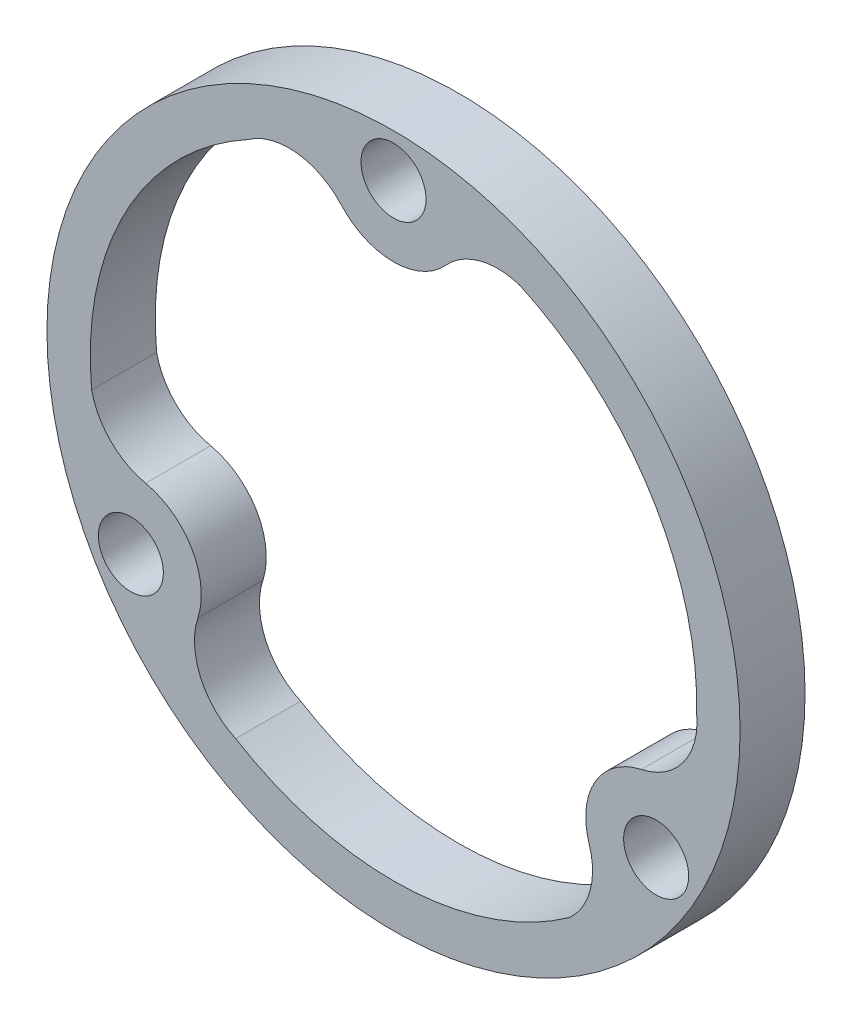
ISO-10303-21;
HEADER;
FILE_DESCRIPTION(('STEP AP214'),'2;1');
FILE_NAME('part.step','',(''),(''),'','','');
FILE_SCHEMA(('AUTOMOTIVE_DESIGN { 1 0 10303 214 1 1 1 1 }'));
ENDSEC;
DATA;
#1=APPLICATION_CONTEXT('core data for automotive mechanical design processes');
#2=APPLICATION_PROTOCOL_DEFINITION('international standard','automotive_design',2000,#1);
#3=PRODUCT_CONTEXT('',#1,'mechanical');
#4=PRODUCT('Part','Part','',(#3));
#5=PRODUCT_RELATED_PRODUCT_CATEGORY('part','',(#4));
#6=PRODUCT_DEFINITION_FORMATION('','',#4);
#7=PRODUCT_DEFINITION_CONTEXT('part definition',#1,'design');
#8=PRODUCT_DEFINITION('design','',#6,#7);
#9=PRODUCT_DEFINITION_SHAPE('','',#8);
#10=(LENGTH_UNIT() NAMED_UNIT(*) SI_UNIT(.MILLI.,.METRE.));
#11=(NAMED_UNIT(*) PLANE_ANGLE_UNIT() SI_UNIT($,.RADIAN.));
#12=(NAMED_UNIT(*) SI_UNIT($,.STERADIAN.) SOLID_ANGLE_UNIT());
#13=UNCERTAINTY_MEASURE_WITH_UNIT(LENGTH_MEASURE(1.E-05),#10,'distance_accuracy_value','');
#14=(GEOMETRIC_REPRESENTATION_CONTEXT(3) GLOBAL_UNCERTAINTY_ASSIGNED_CONTEXT((#13)) GLOBAL_UNIT_ASSIGNED_CONTEXT((#10,
#11,#12)) REPRESENTATION_CONTEXT('',''));
#15=CARTESIAN_POINT('',(0.,0.,0.));
#16=DIRECTION('',(0.,0.,1.));
#17=DIRECTION('',(1.,0.,0.));
#18=AXIS2_PLACEMENT_3D('',#15,#16,#17);
#19=CARTESIAN_POINT('',(0.,0.,3.));
#20=DIRECTION('',(0.,0.,1.));
#21=DIRECTION('',(1.,0.,0.));
#22=AXIS2_PLACEMENT_3D('',#19,#20,#21);
#23=PLANE('',#22);
#24=CARTESIAN_POINT('',(0.,0.,3.));
#25=DIRECTION('',(0.,0.,1.));
#26=DIRECTION('',(1.,0.,0.));
#27=AXIS2_PLACEMENT_3D('',#24,#25,#26);
#28=CIRCLE('',#27,14.);
#29=CARTESIAN_POINT('',(13.9959775932849,-0.335575935174573,3.));
#30=VERTEX_POINT('',#29);
#31=CARTESIAN_POINT('',(5.80943087987062,12.7377593340432,3.));
#32=VERTEX_POINT('',#31);
#33=EDGE_CURVE('E130',#30,#32,#28,.T.);
#34=ORIENTED_EDGE('',*,*,#33,.F.);
#35=CARTESIAN_POINT('',(10.7607074751454,-0.644650784804921,3.));
#36=DIRECTION('',(0.,0.,1.));
#37=DIRECTION('',(1.,0.,0.));
#38=AXIS2_PLACEMENT_3D('',#35,#36,#37);
#39=CIRCLE('',#38,3.25);
#40=CARTESIAN_POINT('',(11.4425315640637,-3.82232539240255,3.));
#41=VERTEX_POINT('',#40);
#42=EDGE_CURVE('E122',#41,#30,#39,.T.);
#43=ORIENTED_EDGE('',*,*,#42,.F.);
#44=CARTESIAN_POINT('',(12.124355652982,-7.00000000000017,3.));
#45=DIRECTION('',(0.,0.,-1.));
#46=DIRECTION('',(1.,0.,0.));
#47=AXIS2_PLACEMENT_3D('',#44,#45,#46);
#48=CIRCLE('',#47,3.25);
#49=CARTESIAN_POINT('',(9.03149667338257,-7.99836032188346,3.));
#50=VERTEX_POINT('',#49);
#51=EDGE_CURVE('E165',#50,#41,#48,.T.);
#52=ORIENTED_EDGE('',*,*,#51,.F.);
#53=CARTESIAN_POINT('',(5.93863769378309,-8.99672064376674,3.));
#54=DIRECTION('',(0.,0.,1.));
#55=DIRECTION('',(1.,0.,0.));
#56=AXIS2_PLACEMENT_3D('',#53,#54,#55);
#57=CIRCLE('',#56,3.25);
#58=CARTESIAN_POINT('',(8.12650773063849,-11.3999943905194,3.));
#59=VERTEX_POINT('',#58);
#60=EDGE_CURVE('E163',#59,#50,#57,.T.);
#61=ORIENTED_EDGE('',*,*,#60,.F.);
#62=CARTESIAN_POINT('',(0.,0.,3.));
#63=DIRECTION('',(0.,0.,1.));
#64=DIRECTION('',(1.,0.,0.));
#65=AXIS2_PLACEMENT_3D('',#62,#63,#64);
#66=CIRCLE('',#65,14.);
#67=CARTESIAN_POINT('',(-7.28860608140232,-11.9530841789952,3.));
#68=VERTEX_POINT('',#67);
#69=EDGE_CURVE('E161',#68,#59,#66,.T.);
#70=ORIENTED_EDGE('',*,*,#69,.F.);
#71=CARTESIAN_POINT('',(-5.93863769378334,-8.99672064376658,3.));
#72=DIRECTION('',(0.,0.,1.));
#73=DIRECTION('',(1.,0.,0.));
#74=AXIS2_PLACEMENT_3D('',#71,#72,#73);
#75=CIRCLE('',#74,3.25);
#76=CARTESIAN_POINT('',(-9.03149667338279,-7.9983603218832,3.));
#77=VERTEX_POINT('',#76);
#78=EDGE_CURVE('E159',#77,#68,#75,.T.);
#79=ORIENTED_EDGE('',*,*,#78,.F.);
#80=CARTESIAN_POINT('',(-12.1243556529822,-6.99999999999983,3.));
#81=DIRECTION('',(0.,0.,-1.));
#82=DIRECTION('',(1.,0.,0.));
#83=AXIS2_PLACEMENT_3D('',#80,#81,#82);
#84=CIRCLE('',#83,3.25);
#85=CARTESIAN_POINT('',(-11.4425315640638,-3.82232539240223,3.));
#86=VERTEX_POINT('',#85);
#87=EDGE_CURVE('E157',#86,#77,#84,.T.);
#88=ORIENTED_EDGE('',*,*,#87,.F.);
#89=CARTESIAN_POINT('',(-10.7607074751454,-0.644650784804622,3.));
#90=DIRECTION('',(0.,0.,1.));
#91=DIRECTION('',(1.,0.,0.));
#92=AXIS2_PLACEMENT_3D('',#89,#90,#91);
#93=CIRCLE('',#92,3.25);
#94=CARTESIAN_POINT('',(-13.9359386105091,-1.33776494352389,3.));
#95=VERTEX_POINT('',#94);
#96=EDGE_CURVE('E155',#95,#86,#93,.T.);
#97=ORIENTED_EDGE('',*,*,#96,.F.);
#98=CARTESIAN_POINT('',(0.,0.,3.));
#99=DIRECTION('',(0.,0.,1.));
#100=DIRECTION('',(1.,0.,0.));
#101=AXIS2_PLACEMENT_3D('',#98,#99,#100);
#102=CIRCLE('',#101,14.);
#103=CARTESIAN_POINT('',(-6.70737151188253,12.2886601141698,3.));
#104=VERTEX_POINT('',#103);
#105=EDGE_CURVE('E153',#104,#95,#102,.T.);
#106=ORIENTED_EDGE('',*,*,#105,.F.);
#107=CARTESIAN_POINT('',(-4.82206978136206,9.6413714285715,3.));
#108=DIRECTION('',(0.,0.,1.));
#109=DIRECTION('',(1.,0.,0.));
#110=AXIS2_PLACEMENT_3D('',#107,#108,#109);
#111=CIRCLE('',#110,3.25);
#112=CARTESIAN_POINT('',(-2.41103489068093,11.8206857142857,3.));
#113=VERTEX_POINT('',#112);
#114=EDGE_CURVE('E151',#113,#104,#111,.T.);
#115=ORIENTED_EDGE('',*,*,#114,.F.);
#116=CARTESIAN_POINT('',(1.99573676599621E-13,14.,3.));
#117=DIRECTION('',(0.,0.,-1.));
#118=DIRECTION('',(1.,0.,0.));
#119=AXIS2_PLACEMENT_3D('',#116,#117,#118);
#120=CIRCLE('',#119,3.25);
#121=CARTESIAN_POINT('',(2.41103489068127,11.8206857142857,3.));
#122=VERTEX_POINT('',#121);
#123=EDGE_CURVE('E146',#122,#113,#120,.T.);
#124=ORIENTED_EDGE('',*,*,#123,.F.);
#125=CARTESIAN_POINT('',(4.82206978136234,9.64137142857136,3.));
#126=DIRECTION('',(0.,0.,1.));
#127=DIRECTION('',(1.,0.,0.));
#128=AXIS2_PLACEMENT_3D('',#125,#126,#127);
#129=CIRCLE('',#128,3.25);
#130=EDGE_CURVE('E144',#32,#122,#129,.T.);
#131=ORIENTED_EDGE('',*,*,#130,.F.);
#132=EDGE_LOOP('',(#34,#43,#52,#61,#70,#79,#88,#97,#106,#115,#124,#131));
#133=FACE_BOUND('',#132,.T.);
#134=CARTESIAN_POINT('',(12.124355652982,-7.00000000000017,3.));
#135=DIRECTION('',(0.,0.,1.));
#136=DIRECTION('',(1.,0.,0.));
#137=AXIS2_PLACEMENT_3D('',#134,#135,#136);
#138=CIRCLE('',#137,1.50000000000007);
#139=CARTESIAN_POINT('',(13.6243556529821,-7.00000000000017,3.));
#140=VERTEX_POINT('',#139);
#141=EDGE_CURVE('E218',#140,#140,#138,.T.);
#142=ORIENTED_EDGE('',*,*,#141,.F.);
#143=EDGE_LOOP('',(#142));
#144=FACE_BOUND('',#143,.T.);
#145=CARTESIAN_POINT('',(0.,0.,3.));
#146=DIRECTION('',(0.,0.,1.));
#147=DIRECTION('',(1.,0.,0.));
#148=AXIS2_PLACEMENT_3D('',#145,#146,#147);
#149=CIRCLE('',#148,16.);
#150=CARTESIAN_POINT('',(16.,0.,3.));
#151=VERTEX_POINT('',#150);
#152=EDGE_CURVE('E11',#151,#151,#149,.T.);
#153=ORIENTED_EDGE('',*,*,#152,.T.);
#154=EDGE_LOOP('',(#153));
#155=FACE_BOUND('',#154,.T.);
#156=CARTESIAN_POINT('',(1.99573676599621E-13,14.,3.));
#157=DIRECTION('',(0.,0.,1.));
#158=DIRECTION('',(1.,0.,0.));
#159=AXIS2_PLACEMENT_3D('',#156,#157,#158);
#160=CIRCLE('',#159,1.50000000000001);
#161=CARTESIAN_POINT('',(1.5000000000002,14.,3.));
#162=VERTEX_POINT('',#161);
#163=EDGE_CURVE('E224',#162,#162,#160,.T.);
#164=ORIENTED_EDGE('',*,*,#163,.F.);
#165=EDGE_LOOP('',(#164));
#166=FACE_BOUND('',#165,.T.);
#167=CARTESIAN_POINT('',(-12.1243556529822,-6.99999999999983,3.));
#168=DIRECTION('',(0.,0.,1.));
#169=DIRECTION('',(1.,0.,0.));
#170=AXIS2_PLACEMENT_3D('',#167,#168,#169);
#171=CIRCLE('',#170,1.5);
#172=CARTESIAN_POINT('',(-10.6243556529822,-6.99999999999983,3.));
#173=VERTEX_POINT('',#172);
#174=EDGE_CURVE('E168',#173,#173,#171,.T.);
#175=ORIENTED_EDGE('',*,*,#174,.F.);
#176=EDGE_LOOP('',(#175));
#177=FACE_BOUND('',#176,.T.);
#178=ADVANCED_FACE('F33',(#133,#144,#155,#166,#177),#23,.T.);
#179=CARTESIAN_POINT('',(0.,0.,0.));
#180=DIRECTION('',(0.,0.,1.));
#181=DIRECTION('',(1.,0.,0.));
#182=AXIS2_PLACEMENT_3D('',#179,#180,#181);
#183=PLANE('',#182);
#184=CARTESIAN_POINT('',(12.124355652982,-7.00000000000017,0.));
#185=DIRECTION('',(0.,0.,1.));
#186=DIRECTION('',(1.,0.,0.));
#187=AXIS2_PLACEMENT_3D('',#184,#185,#186);
#188=CIRCLE('',#187,1.50000000000007);
#189=CARTESIAN_POINT('',(13.6243556529821,-7.00000000000017,0.));
#190=VERTEX_POINT('',#189);
#191=EDGE_CURVE('E138',#190,#190,#188,.T.);
#192=ORIENTED_EDGE('',*,*,#191,.T.);
#193=EDGE_LOOP('',(#192));
#194=FACE_BOUND('',#193,.T.);
#195=CARTESIAN_POINT('',(1.99573676599621E-13,14.,0.));
#196=DIRECTION('',(0.,0.,1.));
#197=DIRECTION('',(1.,0.,0.));
#198=AXIS2_PLACEMENT_3D('',#195,#196,#197);
#199=CIRCLE('',#198,1.50000000000001);
#200=CARTESIAN_POINT('',(1.5000000000002,14.,0.));
#201=VERTEX_POINT('',#200);
#202=EDGE_CURVE('E221',#201,#201,#199,.T.);
#203=ORIENTED_EDGE('',*,*,#202,.T.);
#204=EDGE_LOOP('',(#203));
#205=FACE_BOUND('',#204,.T.);
#206=CARTESIAN_POINT('',(0.,0.,0.));
#207=DIRECTION('',(0.,0.,1.));
#208=DIRECTION('',(1.,0.,0.));
#209=AXIS2_PLACEMENT_3D('',#206,#207,#208);
#210=CIRCLE('',#209,16.);
#211=CARTESIAN_POINT('',(16.,0.,0.));
#212=VERTEX_POINT('',#211);
#213=EDGE_CURVE('E37',#212,#212,#210,.T.);
#214=ORIENTED_EDGE('',*,*,#213,.F.);
#215=EDGE_LOOP('',(#214));
#216=FACE_BOUND('',#215,.T.);
#217=CARTESIAN_POINT('',(10.7607074751454,-0.644650784804921,0.));
#218=DIRECTION('',(0.,0.,1.));
#219=DIRECTION('',(1.,0.,0.));
#220=AXIS2_PLACEMENT_3D('',#217,#218,#219);
#221=CIRCLE('',#220,3.25);
#222=CARTESIAN_POINT('',(11.4425315640637,-3.82232539240255,0.));
#223=VERTEX_POINT('',#222);
#224=CARTESIAN_POINT('',(13.9959775932849,-0.335575935174573,0.));
#225=VERTEX_POINT('',#224);
#226=EDGE_CURVE('E56',#223,#225,#221,.T.);
#227=ORIENTED_EDGE('',*,*,#226,.T.);
#228=CARTESIAN_POINT('',(0.,0.,0.));
#229=DIRECTION('',(0.,0.,1.));
#230=DIRECTION('',(1.,0.,0.));
#231=AXIS2_PLACEMENT_3D('',#228,#229,#230);
#232=CIRCLE('',#231,14.);
#233=CARTESIAN_POINT('',(5.80943087987062,12.7377593340432,0.));
#234=VERTEX_POINT('',#233);
#235=EDGE_CURVE('E137',#225,#234,#232,.T.);
#236=ORIENTED_EDGE('',*,*,#235,.T.);
#237=CARTESIAN_POINT('',(4.82206978136234,9.64137142857136,0.));
#238=DIRECTION('',(0.,0.,1.));
#239=DIRECTION('',(1.,0.,0.));
#240=AXIS2_PLACEMENT_3D('',#237,#238,#239);
#241=CIRCLE('',#240,3.25);
#242=CARTESIAN_POINT('',(2.41103489068127,11.8206857142857,0.));
#243=VERTEX_POINT('',#242);
#244=EDGE_CURVE('E170',#234,#243,#241,.T.);
#245=ORIENTED_EDGE('',*,*,#244,.T.);
#246=CARTESIAN_POINT('',(1.99573676599621E-13,14.,0.));
#247=DIRECTION('',(0.,0.,-1.));
#248=DIRECTION('',(1.,0.,0.));
#249=AXIS2_PLACEMENT_3D('',#246,#247,#248);
#250=CIRCLE('',#249,3.25);
#251=CARTESIAN_POINT('',(-2.41103489068093,11.8206857142857,0.));
#252=VERTEX_POINT('',#251);
#253=EDGE_CURVE('E173',#243,#252,#250,.T.);
#254=ORIENTED_EDGE('',*,*,#253,.T.);
#255=CARTESIAN_POINT('',(-4.82206978136206,9.6413714285715,0.));
#256=DIRECTION('',(0.,0.,1.));
#257=DIRECTION('',(1.,0.,0.));
#258=AXIS2_PLACEMENT_3D('',#255,#256,#257);
#259=CIRCLE('',#258,3.25);
#260=CARTESIAN_POINT('',(-6.70737151188253,12.2886601141698,0.));
#261=VERTEX_POINT('',#260);
#262=EDGE_CURVE('E176',#252,#261,#259,.T.);
#263=ORIENTED_EDGE('',*,*,#262,.T.);
#264=CARTESIAN_POINT('',(0.,0.,0.));
#265=DIRECTION('',(0.,0.,1.));
#266=DIRECTION('',(1.,0.,0.));
#267=AXIS2_PLACEMENT_3D('',#264,#265,#266);
#268=CIRCLE('',#267,14.);
#269=CARTESIAN_POINT('',(-13.9359386105091,-1.33776494352389,0.));
#270=VERTEX_POINT('',#269);
#271=EDGE_CURVE('E179',#261,#270,#268,.T.);
#272=ORIENTED_EDGE('',*,*,#271,.T.);
#273=CARTESIAN_POINT('',(-10.7607074751454,-0.644650784804622,0.));
#274=DIRECTION('',(0.,0.,1.));
#275=DIRECTION('',(1.,0.,0.));
#276=AXIS2_PLACEMENT_3D('',#273,#274,#275);
#277=CIRCLE('',#276,3.25);
#278=CARTESIAN_POINT('',(-11.4425315640638,-3.82232539240223,0.));
#279=VERTEX_POINT('',#278);
#280=EDGE_CURVE('E182',#270,#279,#277,.T.);
#281=ORIENTED_EDGE('',*,*,#280,.T.);
#282=CARTESIAN_POINT('',(-12.1243556529822,-6.99999999999983,0.));
#283=DIRECTION('',(0.,0.,-1.));
#284=DIRECTION('',(1.,0.,0.));
#285=AXIS2_PLACEMENT_3D('',#282,#283,#284);
#286=CIRCLE('',#285,3.25);
#287=CARTESIAN_POINT('',(-9.03149667338279,-7.9983603218832,0.));
#288=VERTEX_POINT('',#287);
#289=EDGE_CURVE('E185',#279,#288,#286,.T.);
#290=ORIENTED_EDGE('',*,*,#289,.T.);
#291=CARTESIAN_POINT('',(-5.93863769378334,-8.99672064376658,0.));
#292=DIRECTION('',(0.,0.,1.));
#293=DIRECTION('',(1.,0.,0.));
#294=AXIS2_PLACEMENT_3D('',#291,#292,#293);
#295=CIRCLE('',#294,3.25);
#296=CARTESIAN_POINT('',(-7.28860608140232,-11.9530841789952,0.));
#297=VERTEX_POINT('',#296);
#298=EDGE_CURVE('E188',#288,#297,#295,.T.);
#299=ORIENTED_EDGE('',*,*,#298,.T.);
#300=CARTESIAN_POINT('',(0.,0.,0.));
#301=DIRECTION('',(0.,0.,1.));
#302=DIRECTION('',(1.,0.,0.));
#303=AXIS2_PLACEMENT_3D('',#300,#301,#302);
#304=CIRCLE('',#303,14.);
#305=CARTESIAN_POINT('',(8.12650773063849,-11.3999943905194,0.));
#306=VERTEX_POINT('',#305);
#307=EDGE_CURVE('E191',#297,#306,#304,.T.);
#308=ORIENTED_EDGE('',*,*,#307,.T.);
#309=CARTESIAN_POINT('',(5.93863769378309,-8.99672064376674,0.));
#310=DIRECTION('',(0.,0.,1.));
#311=DIRECTION('',(1.,0.,0.));
#312=AXIS2_PLACEMENT_3D('',#309,#310,#311);
#313=CIRCLE('',#312,3.25);
#314=CARTESIAN_POINT('',(9.03149667338257,-7.99836032188346,0.));
#315=VERTEX_POINT('',#314);
#316=EDGE_CURVE('E194',#306,#315,#313,.T.);
#317=ORIENTED_EDGE('',*,*,#316,.T.);
#318=CARTESIAN_POINT('',(12.124355652982,-7.00000000000017,0.));
#319=DIRECTION('',(0.,0.,-1.));
#320=DIRECTION('',(1.,0.,0.));
#321=AXIS2_PLACEMENT_3D('',#318,#319,#320);
#322=CIRCLE('',#321,3.25);
#323=EDGE_CURVE('E131',#315,#223,#322,.T.);
#324=ORIENTED_EDGE('',*,*,#323,.T.);
#325=EDGE_LOOP('',(#227,#236,#245,#254,#263,#272,#281,#290,#299,#308,#317,#324));
#326=FACE_BOUND('',#325,.T.);
#327=CARTESIAN_POINT('',(-12.1243556529822,-6.99999999999983,0.));
#328=DIRECTION('',(0.,0.,1.));
#329=DIRECTION('',(1.,0.,0.));
#330=AXIS2_PLACEMENT_3D('',#327,#328,#329);
#331=CIRCLE('',#330,1.5);
#332=CARTESIAN_POINT('',(-10.6243556529822,-6.99999999999983,0.));
#333=VERTEX_POINT('',#332);
#334=EDGE_CURVE('E403',#333,#333,#331,.T.);
#335=ORIENTED_EDGE('',*,*,#334,.T.);
#336=EDGE_LOOP('',(#335));
#337=FACE_BOUND('',#336,.T.);
#338=ADVANCED_FACE('F230',(#194,#205,#216,#326,#337),#183,.F.);
#339=CARTESIAN_POINT('',(0.,0.,3.));
#340=DIRECTION('',(0.,0.,-1.));
#341=DIRECTION('',(-1.,0.,0.));
#342=AXIS2_PLACEMENT_3D('',#339,#340,#341);
#343=CYLINDRICAL_SURFACE('',#342,16.);
#344=ORIENTED_EDGE('',*,*,#152,.F.);
#345=EDGE_LOOP('',(#344));
#346=FACE_BOUND('',#345,.T.);
#347=ORIENTED_EDGE('',*,*,#213,.T.);
#348=EDGE_LOOP('',(#347));
#349=FACE_BOUND('',#348,.T.);
#350=ADVANCED_FACE('F35',(#346,#349),#343,.T.);
#351=CARTESIAN_POINT('',(1.99573676599621E-13,14.,3.));
#352=DIRECTION('',(0.,0.,-1.));
#353=DIRECTION('',(-1.,0.,0.));
#354=AXIS2_PLACEMENT_3D('',#351,#352,#353);
#355=CYLINDRICAL_SURFACE('',#354,1.50000000000001);
#356=ORIENTED_EDGE('',*,*,#163,.T.);
#357=EDGE_LOOP('',(#356));
#358=FACE_BOUND('',#357,.T.);
#359=ORIENTED_EDGE('',*,*,#202,.F.);
#360=EDGE_LOOP('',(#359));
#361=FACE_BOUND('',#360,.T.);
#362=ADVANCED_FACE('F233',(#358,#361),#355,.F.);
#363=CARTESIAN_POINT('',(12.124355652982,-7.00000000000017,3.));
#364=DIRECTION('',(0.,0.,-1.));
#365=DIRECTION('',(-1.,0.,0.));
#366=AXIS2_PLACEMENT_3D('',#363,#364,#365);
#367=CYLINDRICAL_SURFACE('',#366,1.50000000000007);
#368=ORIENTED_EDGE('',*,*,#141,.T.);
#369=EDGE_LOOP('',(#368));
#370=FACE_BOUND('',#369,.T.);
#371=ORIENTED_EDGE('',*,*,#191,.F.);
#372=EDGE_LOOP('',(#371));
#373=FACE_BOUND('',#372,.T.);
#374=ADVANCED_FACE('F235',(#370,#373),#367,.F.);
#375=CARTESIAN_POINT('',(10.7607074751454,-0.644650784804921,3.));
#376=DIRECTION('',(0.,0.,-1.));
#377=DIRECTION('',(-1.,0.,0.));
#378=AXIS2_PLACEMENT_3D('',#375,#376,#377);
#379=CYLINDRICAL_SURFACE('',#378,3.25);
#380=ORIENTED_EDGE('',*,*,#226,.F.);
#381=DIRECTION('',(0.,0.,-1.));
#382=VECTOR('',#381,1.);
#383=CARTESIAN_POINT('',(11.4425315640637,-3.82232539240255,3.));
#384=LINE('',#383,#382);
#385=EDGE_CURVE('E126',#41,#223,#384,.T.);
#386=ORIENTED_EDGE('',*,*,#385,.F.);
#387=ORIENTED_EDGE('',*,*,#42,.T.);
#388=DIRECTION('',(0.,0.,-1.));
#389=VECTOR('',#388,1.);
#390=CARTESIAN_POINT('',(13.9959775932849,-0.335575935174573,3.));
#391=LINE('',#390,#389);
#392=EDGE_CURVE('E125',#30,#225,#391,.T.);
#393=ORIENTED_EDGE('',*,*,#392,.T.);
#394=EDGE_LOOP('',(#380,#386,#387,#393));
#395=FACE_BOUND('',#394,.T.);
#396=ADVANCED_FACE('F124',(#395),#379,.F.);
#397=CARTESIAN_POINT('',(0.,0.,3.));
#398=DIRECTION('',(0.,0.,-1.));
#399=DIRECTION('',(-1.,0.,0.));
#400=AXIS2_PLACEMENT_3D('',#397,#398,#399);
#401=CYLINDRICAL_SURFACE('',#400,14.);
#402=ORIENTED_EDGE('',*,*,#235,.F.);
#403=ORIENTED_EDGE('',*,*,#392,.F.);
#404=ORIENTED_EDGE('',*,*,#33,.T.);
#405=DIRECTION('',(0.,0.,-1.));
#406=VECTOR('',#405,1.);
#407=CARTESIAN_POINT('',(5.80943087987062,12.7377593340432,3.));
#408=LINE('',#407,#406);
#409=EDGE_CURVE('E139',#32,#234,#408,.T.);
#410=ORIENTED_EDGE('',*,*,#409,.T.);
#411=EDGE_LOOP('',(#402,#403,#404,#410));
#412=FACE_BOUND('',#411,.T.);
#413=ADVANCED_FACE('F134',(#412),#401,.F.);
#414=CARTESIAN_POINT('',(4.82206978136234,9.64137142857136,3.));
#415=DIRECTION('',(0.,0.,-1.));
#416=DIRECTION('',(-1.,0.,0.));
#417=AXIS2_PLACEMENT_3D('',#414,#415,#416);
#418=CYLINDRICAL_SURFACE('',#417,3.25);
#419=ORIENTED_EDGE('',*,*,#244,.F.);
#420=ORIENTED_EDGE('',*,*,#409,.F.);
#421=ORIENTED_EDGE('',*,*,#130,.T.);
#422=DIRECTION('',(0.,0.,-1.));
#423=VECTOR('',#422,1.);
#424=CARTESIAN_POINT('',(2.41103489068127,11.8206857142857,3.));
#425=LINE('',#424,#423);
#426=EDGE_CURVE('E215',#122,#243,#425,.T.);
#427=ORIENTED_EDGE('',*,*,#426,.T.);
#428=EDGE_LOOP('',(#419,#420,#421,#427));
#429=FACE_BOUND('',#428,.T.);
#430=ADVANCED_FACE('F286',(#429),#418,.F.);
#431=CARTESIAN_POINT('',(1.99573676599621E-13,14.,3.));
#432=DIRECTION('',(0.,0.,-1.));
#433=DIRECTION('',(-1.,0.,0.));
#434=AXIS2_PLACEMENT_3D('',#431,#432,#433);
#435=CYLINDRICAL_SURFACE('',#434,3.25);
#436=ORIENTED_EDGE('',*,*,#253,.F.);
#437=ORIENTED_EDGE('',*,*,#426,.F.);
#438=ORIENTED_EDGE('',*,*,#123,.T.);
#439=DIRECTION('',(0.,0.,-1.));
#440=VECTOR('',#439,1.);
#441=CARTESIAN_POINT('',(-2.41103489068093,11.8206857142857,3.));
#442=LINE('',#441,#440);
#443=EDGE_CURVE('E213',#113,#252,#442,.T.);
#444=ORIENTED_EDGE('',*,*,#443,.T.);
#445=EDGE_LOOP('',(#436,#437,#438,#444));
#446=FACE_BOUND('',#445,.T.);
#447=ADVANCED_FACE('F295',(#446),#435,.T.);
#448=CARTESIAN_POINT('',(-4.82206978136206,9.6413714285715,3.));
#449=DIRECTION('',(0.,0.,-1.));
#450=DIRECTION('',(-1.,0.,0.));
#451=AXIS2_PLACEMENT_3D('',#448,#449,#450);
#452=CYLINDRICAL_SURFACE('',#451,3.25);
#453=ORIENTED_EDGE('',*,*,#262,.F.);
#454=ORIENTED_EDGE('',*,*,#443,.F.);
#455=ORIENTED_EDGE('',*,*,#114,.T.);
#456=DIRECTION('',(0.,0.,-1.));
#457=VECTOR('',#456,1.);
#458=CARTESIAN_POINT('',(-6.70737151188253,12.2886601141698,3.));
#459=LINE('',#458,#457);
#460=EDGE_CURVE('E211',#104,#261,#459,.T.);
#461=ORIENTED_EDGE('',*,*,#460,.T.);
#462=EDGE_LOOP('',(#453,#454,#455,#461));
#463=FACE_BOUND('',#462,.T.);
#464=ADVANCED_FACE('F305',(#463),#452,.F.);
#465=CARTESIAN_POINT('',(0.,0.,3.));
#466=DIRECTION('',(0.,0.,-1.));
#467=DIRECTION('',(-1.,0.,0.));
#468=AXIS2_PLACEMENT_3D('',#465,#466,#467);
#469=CYLINDRICAL_SURFACE('',#468,14.);
#470=ORIENTED_EDGE('',*,*,#271,.F.);
#471=ORIENTED_EDGE('',*,*,#460,.F.);
#472=ORIENTED_EDGE('',*,*,#105,.T.);
#473=DIRECTION('',(0.,0.,-1.));
#474=VECTOR('',#473,1.);
#475=CARTESIAN_POINT('',(-13.9359386105091,-1.33776494352389,3.));
#476=LINE('',#475,#474);
#477=EDGE_CURVE('E209',#95,#270,#476,.T.);
#478=ORIENTED_EDGE('',*,*,#477,.T.);
#479=EDGE_LOOP('',(#470,#471,#472,#478));
#480=FACE_BOUND('',#479,.T.);
#481=ADVANCED_FACE('F315',(#480),#469,.F.);
#482=CARTESIAN_POINT('',(-10.7607074751454,-0.644650784804622,3.));
#483=DIRECTION('',(0.,0.,-1.));
#484=DIRECTION('',(-1.,0.,0.));
#485=AXIS2_PLACEMENT_3D('',#482,#483,#484);
#486=CYLINDRICAL_SURFACE('',#485,3.25);
#487=ORIENTED_EDGE('',*,*,#280,.F.);
#488=ORIENTED_EDGE('',*,*,#477,.F.);
#489=ORIENTED_EDGE('',*,*,#96,.T.);
#490=DIRECTION('',(0.,0.,-1.));
#491=VECTOR('',#490,1.);
#492=CARTESIAN_POINT('',(-11.4425315640638,-3.82232539240223,3.));
#493=LINE('',#492,#491);
#494=EDGE_CURVE('E207',#86,#279,#493,.T.);
#495=ORIENTED_EDGE('',*,*,#494,.T.);
#496=EDGE_LOOP('',(#487,#488,#489,#495));
#497=FACE_BOUND('',#496,.T.);
#498=ADVANCED_FACE('F325',(#497),#486,.F.);
#499=CARTESIAN_POINT('',(-12.1243556529822,-6.99999999999983,3.));
#500=DIRECTION('',(0.,0.,-1.));
#501=DIRECTION('',(-1.,0.,0.));
#502=AXIS2_PLACEMENT_3D('',#499,#500,#501);
#503=CYLINDRICAL_SURFACE('',#502,3.25);
#504=ORIENTED_EDGE('',*,*,#289,.F.);
#505=ORIENTED_EDGE('',*,*,#494,.F.);
#506=ORIENTED_EDGE('',*,*,#87,.T.);
#507=DIRECTION('',(0.,0.,-1.));
#508=VECTOR('',#507,1.);
#509=CARTESIAN_POINT('',(-9.03149667338279,-7.9983603218832,3.));
#510=LINE('',#509,#508);
#511=EDGE_CURVE('E205',#77,#288,#510,.T.);
#512=ORIENTED_EDGE('',*,*,#511,.T.);
#513=EDGE_LOOP('',(#504,#505,#506,#512));
#514=FACE_BOUND('',#513,.T.);
#515=ADVANCED_FACE('F335',(#514),#503,.T.);
#516=CARTESIAN_POINT('',(-5.93863769378334,-8.99672064376658,3.));
#517=DIRECTION('',(0.,0.,-1.));
#518=DIRECTION('',(-1.,0.,0.));
#519=AXIS2_PLACEMENT_3D('',#516,#517,#518);
#520=CYLINDRICAL_SURFACE('',#519,3.25);
#521=ORIENTED_EDGE('',*,*,#298,.F.);
#522=ORIENTED_EDGE('',*,*,#511,.F.);
#523=ORIENTED_EDGE('',*,*,#78,.T.);
#524=DIRECTION('',(0.,0.,-1.));
#525=VECTOR('',#524,1.);
#526=CARTESIAN_POINT('',(-7.28860608140232,-11.9530841789952,3.));
#527=LINE('',#526,#525);
#528=EDGE_CURVE('E203',#68,#297,#527,.T.);
#529=ORIENTED_EDGE('',*,*,#528,.T.);
#530=EDGE_LOOP('',(#521,#522,#523,#529));
#531=FACE_BOUND('',#530,.T.);
#532=ADVANCED_FACE('F345',(#531),#520,.F.);
#533=CARTESIAN_POINT('',(0.,0.,3.));
#534=DIRECTION('',(0.,0.,-1.));
#535=DIRECTION('',(-1.,0.,0.));
#536=AXIS2_PLACEMENT_3D('',#533,#534,#535);
#537=CYLINDRICAL_SURFACE('',#536,14.);
#538=ORIENTED_EDGE('',*,*,#307,.F.);
#539=ORIENTED_EDGE('',*,*,#528,.F.);
#540=ORIENTED_EDGE('',*,*,#69,.T.);
#541=DIRECTION('',(0.,0.,-1.));
#542=VECTOR('',#541,1.);
#543=CARTESIAN_POINT('',(8.12650773063849,-11.3999943905194,3.));
#544=LINE('',#543,#542);
#545=EDGE_CURVE('E201',#59,#306,#544,.T.);
#546=ORIENTED_EDGE('',*,*,#545,.T.);
#547=EDGE_LOOP('',(#538,#539,#540,#546));
#548=FACE_BOUND('',#547,.T.);
#549=ADVANCED_FACE('F355',(#548),#537,.F.);
#550=CARTESIAN_POINT('',(5.93863769378309,-8.99672064376674,3.));
#551=DIRECTION('',(0.,0.,-1.));
#552=DIRECTION('',(-1.,0.,0.));
#553=AXIS2_PLACEMENT_3D('',#550,#551,#552);
#554=CYLINDRICAL_SURFACE('',#553,3.25);
#555=ORIENTED_EDGE('',*,*,#316,.F.);
#556=ORIENTED_EDGE('',*,*,#545,.F.);
#557=ORIENTED_EDGE('',*,*,#60,.T.);
#558=DIRECTION('',(0.,0.,-1.));
#559=VECTOR('',#558,1.);
#560=CARTESIAN_POINT('',(9.03149667338257,-7.99836032188346,3.));
#561=LINE('',#560,#559);
#562=EDGE_CURVE('E48',#50,#315,#561,.T.);
#563=ORIENTED_EDGE('',*,*,#562,.T.);
#564=EDGE_LOOP('',(#555,#556,#557,#563));
#565=FACE_BOUND('',#564,.T.);
#566=ADVANCED_FACE('F365',(#565),#554,.F.);
#567=CARTESIAN_POINT('',(12.124355652982,-7.00000000000017,3.));
#568=DIRECTION('',(0.,0.,-1.));
#569=DIRECTION('',(-1.,0.,0.));
#570=AXIS2_PLACEMENT_3D('',#567,#568,#569);
#571=CYLINDRICAL_SURFACE('',#570,3.25);
#572=ORIENTED_EDGE('',*,*,#323,.F.);
#573=ORIENTED_EDGE('',*,*,#562,.F.);
#574=ORIENTED_EDGE('',*,*,#51,.T.);
#575=ORIENTED_EDGE('',*,*,#385,.T.);
#576=EDGE_LOOP('',(#572,#573,#574,#575));
#577=FACE_BOUND('',#576,.T.);
#578=ADVANCED_FACE('F375',(#577),#571,.T.);
#579=CARTESIAN_POINT('',(-12.1243556529822,-6.99999999999983,3.));
#580=DIRECTION('',(0.,0.,-1.));
#581=DIRECTION('',(-1.,0.,0.));
#582=AXIS2_PLACEMENT_3D('',#579,#580,#581);
#583=CYLINDRICAL_SURFACE('',#582,1.5);
#584=ORIENTED_EDGE('',*,*,#174,.T.);
#585=EDGE_LOOP('',(#584));
#586=FACE_BOUND('',#585,.T.);
#587=ORIENTED_EDGE('',*,*,#334,.F.);
#588=EDGE_LOOP('',(#587));
#589=FACE_BOUND('',#588,.T.);
#590=ADVANCED_FACE('F385',(#586,#589),#583,.F.);
#591=CLOSED_SHELL('',(#178,#338,#350,#362,#374,#396,#413,#430,#447,#464,#481,#498,#515,#532,
#549,#566,#578,#590));
#592=MANIFOLD_SOLID_BREP('B2',#591);
#593=ADVANCED_BREP_SHAPE_REPRESENTATION('',(#18,#592),#14);
#594=SHAPE_DEFINITION_REPRESENTATION(#9,#593);
ENDSEC;
END-ISO-10303-21;
